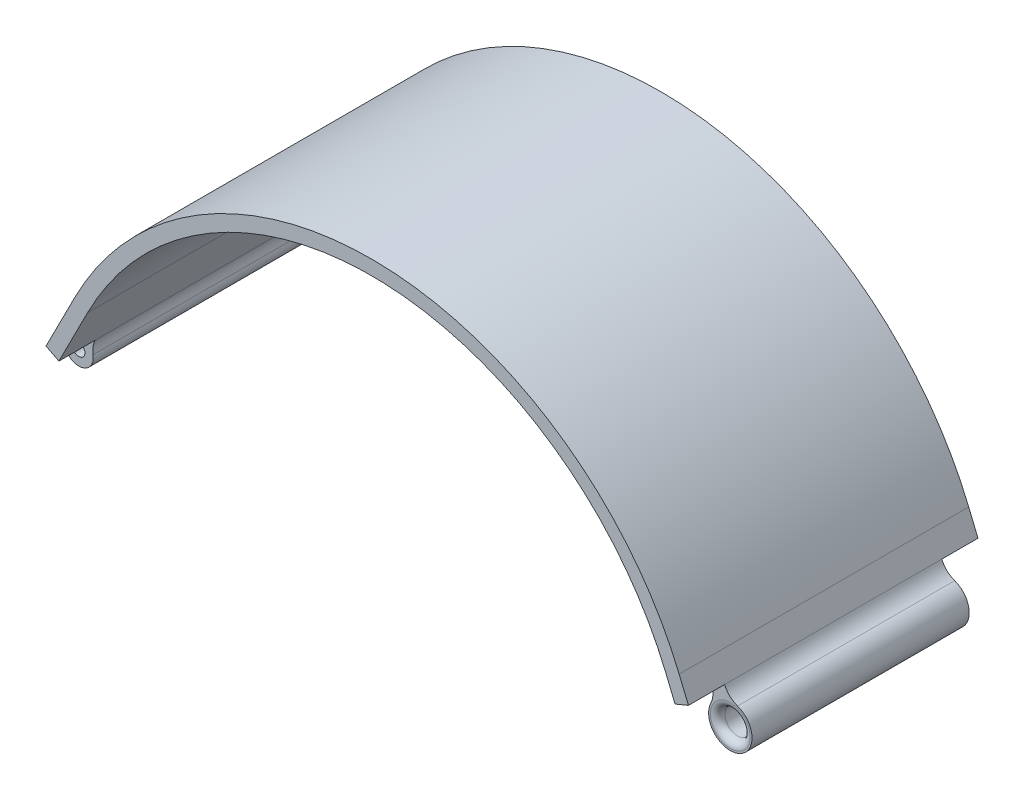
ISO-10303-21;
HEADER;
FILE_DESCRIPTION(('STEP AP214'),'2;1');
FILE_NAME('part.step','',(''),(''),'','','');
FILE_SCHEMA(('AUTOMOTIVE_DESIGN { 1 0 10303 214 1 1 1 1 }'));
ENDSEC;
DATA;
#1=APPLICATION_CONTEXT('core data for automotive mechanical design processes');
#2=APPLICATION_PROTOCOL_DEFINITION('international standard','automotive_design',2000,#1);
#3=PRODUCT_CONTEXT('',#1,'mechanical');
#4=PRODUCT('Part','Part','',(#3));
#5=PRODUCT_RELATED_PRODUCT_CATEGORY('part','',(#4));
#6=PRODUCT_DEFINITION_FORMATION('','',#4);
#7=PRODUCT_DEFINITION_CONTEXT('part definition',#1,'design');
#8=PRODUCT_DEFINITION('design','',#6,#7);
#9=PRODUCT_DEFINITION_SHAPE('','',#8);
#10=(LENGTH_UNIT() NAMED_UNIT(*) SI_UNIT(.MILLI.,.METRE.));
#11=(NAMED_UNIT(*) PLANE_ANGLE_UNIT() SI_UNIT($,.RADIAN.));
#12=(NAMED_UNIT(*) SI_UNIT($,.STERADIAN.) SOLID_ANGLE_UNIT());
#13=UNCERTAINTY_MEASURE_WITH_UNIT(LENGTH_MEASURE(1.E-05),#10,'distance_accuracy_value','');
#14=(GEOMETRIC_REPRESENTATION_CONTEXT(3) GLOBAL_UNCERTAINTY_ASSIGNED_CONTEXT((#13)) GLOBAL_UNIT_ASSIGNED_CONTEXT((#10,
#11,#12)) REPRESENTATION_CONTEXT('',''));
#15=CARTESIAN_POINT('',(0.,0.,0.));
#16=DIRECTION('',(0.,0.,1.));
#17=DIRECTION('',(1.,0.,0.));
#18=AXIS2_PLACEMENT_3D('',#15,#16,#17);
#19=CARTESIAN_POINT('',(89.1515917232898,0.,40.));
#20=DIRECTION('',(0.,0.,-1.));
#21=DIRECTION('',(-1.,0.,0.));
#22=AXIS2_PLACEMENT_3D('',#19,#20,#21);
#23=CYLINDRICAL_SURFACE('',#22,6.);
#24=CARTESIAN_POINT('',(89.1515917232898,0.,30.));
#25=DIRECTION('',(0.,0.,-1.));
#26=DIRECTION('',(-1.,0.,0.));
#27=AXIS2_PLACEMENT_3D('',#24,#25,#26);
#28=CIRCLE('',#27,6.00000000000001);
#29=CARTESIAN_POINT('',(91.1387665342734,5.66137229570643,30.));
#30=VERTEX_POINT('',#29);
#31=CARTESIAN_POINT('',(83.7460719026731,2.60391157087167,30.));
#32=VERTEX_POINT('',#31);
#33=EDGE_CURVE('E369',#30,#32,#28,.T.);
#34=ORIENTED_EDGE('',*,*,#33,.T.);
#35=DIRECTION('',(0.,0.,-1.));
#36=VECTOR('',#35,1.);
#37=CARTESIAN_POINT('',(83.7460719026731,2.60391157087167,40.));
#38=LINE('',#37,#36);
#39=CARTESIAN_POINT('',(83.7460719026731,2.60391157087167,-30.));
#40=VERTEX_POINT('',#39);
#41=EDGE_CURVE('E288',#32,#40,#38,.T.);
#42=ORIENTED_EDGE('',*,*,#41,.T.);
#43=CARTESIAN_POINT('',(89.1515917232898,0.,-30.));
#44=DIRECTION('',(0.,0.,-1.));
#45=DIRECTION('',(-1.,0.,0.));
#46=AXIS2_PLACEMENT_3D('',#43,#44,#45);
#47=CIRCLE('',#46,6.00000000000001);
#48=CARTESIAN_POINT('',(91.1387665342734,5.66137229570643,-30.));
#49=VERTEX_POINT('',#48);
#50=EDGE_CURVE('E349',#49,#40,#47,.T.);
#51=ORIENTED_EDGE('',*,*,#50,.F.);
#52=DIRECTION('',(0.,0.,-1.));
#53=VECTOR('',#52,1.);
#54=CARTESIAN_POINT('',(91.1387665342734,5.66137229570643,40.));
#55=LINE('',#54,#53);
#56=EDGE_CURVE('E290',#49,#30,#55,.F.);
#57=ORIENTED_EDGE('',*,*,#56,.T.);
#58=EDGE_LOOP('',(#34,#42,#51,#57));
#59=FACE_BOUND('',#58,.T.);
#60=ADVANCED_FACE('F48',(#59),#23,.T.);
#61=CARTESIAN_POINT('',(-90.8484082767102,0.,40.));
#62=DIRECTION('',(0.,0.,-1.));
#63=DIRECTION('',(-1.,0.,0.));
#64=AXIS2_PLACEMENT_3D('',#61,#62,#63);
#65=CYLINDRICAL_SURFACE('',#64,3.99999999999999);
#66=CARTESIAN_POINT('',(-90.8484082767102,0.,30.));
#67=DIRECTION('',(0.,0.,-1.));
#68=DIRECTION('',(-1.,0.,0.));
#69=AXIS2_PLACEMENT_3D('',#66,#67,#68);
#70=CIRCLE('',#69,3.99999999999999);
#71=CARTESIAN_POINT('',(-86.9077940215449,0.686701748933145,30.));
#72=VERTEX_POINT('',#71);
#73=CARTESIAN_POINT('',(-92.6110139471323,3.59071319525742,30.));
#74=VERTEX_POINT('',#73);
#75=EDGE_CURVE('E173',#72,#74,#70,.T.);
#76=ORIENTED_EDGE('',*,*,#75,.T.);
#77=DIRECTION('',(0.,0.,-1.));
#78=VECTOR('',#77,1.);
#79=CARTESIAN_POINT('',(-92.6110139471323,3.59071319525741,40.));
#80=LINE('',#79,#78);
#81=CARTESIAN_POINT('',(-92.6110139471323,3.59071319525742,-30.));
#82=VERTEX_POINT('',#81);
#83=EDGE_CURVE('E187',#74,#82,#80,.T.);
#84=ORIENTED_EDGE('',*,*,#83,.T.);
#85=CARTESIAN_POINT('',(-90.8484082767102,0.,-30.));
#86=DIRECTION('',(0.,0.,-1.));
#87=DIRECTION('',(-1.,0.,0.));
#88=AXIS2_PLACEMENT_3D('',#85,#86,#87);
#89=CIRCLE('',#88,3.99999999999999);
#90=CARTESIAN_POINT('',(-86.9077940215449,0.686701748933145,-30.));
#91=VERTEX_POINT('',#90);
#92=EDGE_CURVE('E278',#91,#82,#89,.T.);
#93=ORIENTED_EDGE('',*,*,#92,.F.);
#94=DIRECTION('',(0.,0.,-1.));
#95=VECTOR('',#94,1.);
#96=CARTESIAN_POINT('',(-86.9077940215449,0.686701748933146,40.));
#97=LINE('',#96,#95);
#98=EDGE_CURVE('E194',#91,#72,#97,.F.);
#99=ORIENTED_EDGE('',*,*,#98,.T.);
#100=EDGE_LOOP('',(#76,#84,#93,#99));
#101=FACE_BOUND('',#100,.T.);
#102=ADVANCED_FACE('F222',(#101),#65,.T.);
#103=CARTESIAN_POINT('',(89.1515917232898,0.,40.));
#104=DIRECTION('',(0.,0.,-1.));
#105=DIRECTION('',(-1.,0.,0.));
#106=AXIS2_PLACEMENT_3D('',#103,#104,#105);
#107=CYLINDRICAL_SURFACE('',#106,3.50000000000001);
#108=CARTESIAN_POINT('',(89.1515917232898,0.,-28.));
#109=DIRECTION('',(0.,0.,-1.));
#110=DIRECTION('',(-1.,0.,0.));
#111=AXIS2_PLACEMENT_3D('',#108,#109,#110);
#112=CIRCLE('',#111,3.50000000000001);
#113=CARTESIAN_POINT('',(85.6515917232898,0.,-28.));
#114=VERTEX_POINT('',#113);
#115=EDGE_CURVE('E204',#114,#114,#112,.T.);
#116=ORIENTED_EDGE('',*,*,#115,.T.);
#117=EDGE_LOOP('',(#116));
#118=FACE_BOUND('',#117,.T.);
#119=CARTESIAN_POINT('',(89.1515917232898,0.,28.));
#120=DIRECTION('',(0.,0.,1.));
#121=DIRECTION('',(1.,0.,0.));
#122=AXIS2_PLACEMENT_3D('',#119,#120,#121);
#123=CIRCLE('',#122,3.50000000000001);
#124=CARTESIAN_POINT('',(92.6515917232898,0.,28.));
#125=VERTEX_POINT('',#124);
#126=EDGE_CURVE('E201',#125,#125,#123,.T.);
#127=ORIENTED_EDGE('',*,*,#126,.T.);
#128=EDGE_LOOP('',(#127));
#129=FACE_BOUND('',#128,.T.);
#130=ADVANCED_FACE('F218',(#118,#129),#107,.F.);
#131=CARTESIAN_POINT('',(-90.8484082767102,0.,40.));
#132=DIRECTION('',(0.,0.,-1.));
#133=DIRECTION('',(-1.,0.,0.));
#134=AXIS2_PLACEMENT_3D('',#131,#132,#133);
#135=CYLINDRICAL_SURFACE('',#134,1.7);
#136=CARTESIAN_POINT('',(-90.8484082767102,0.,-30.));
#137=DIRECTION('',(0.,0.,-1.));
#138=DIRECTION('',(-1.,0.,0.));
#139=AXIS2_PLACEMENT_3D('',#136,#137,#138);
#140=CIRCLE('',#139,1.7);
#141=CARTESIAN_POINT('',(-92.5484082767102,0.,-30.));
#142=VERTEX_POINT('',#141);
#143=EDGE_CURVE('E321',#142,#142,#140,.T.);
#144=ORIENTED_EDGE('',*,*,#143,.T.);
#145=EDGE_LOOP('',(#144));
#146=FACE_BOUND('',#145,.T.);
#147=CARTESIAN_POINT('',(-90.8484082767102,0.,30.));
#148=DIRECTION('',(0.,0.,1.));
#149=DIRECTION('',(1.,0.,0.));
#150=AXIS2_PLACEMENT_3D('',#147,#148,#149);
#151=CIRCLE('',#150,1.7);
#152=CARTESIAN_POINT('',(-89.1484082767102,0.,30.));
#153=VERTEX_POINT('',#152);
#154=EDGE_CURVE('E172',#153,#153,#151,.T.);
#155=ORIENTED_EDGE('',*,*,#154,.T.);
#156=EDGE_LOOP('',(#155));
#157=FACE_BOUND('',#156,.T.);
#158=ADVANCED_FACE('F221',(#146,#157),#135,.F.);
#159=CARTESIAN_POINT('',(78.3405520820563,5.20782314174335,40.));
#160=DIRECTION('',(0.,0.,-1.));
#161=DIRECTION('',(-1.,0.,0.));
#162=AXIS2_PLACEMENT_3D('',#159,#160,#161);
#163=CYLINDRICAL_SURFACE('',#162,6.);
#164=CARTESIAN_POINT('',(78.3405520820563,5.20782314174335,30.));
#165=DIRECTION('',(0.,0.,1.));
#166=DIRECTION('',(-1.,0.,0.));
#167=AXIS2_PLACEMENT_3D('',#164,#165,#166);
#168=CIRCLE('',#167,6.);
#169=CARTESIAN_POINT('',(83.8850730557566,7.5009186853694,30.));
#170=VERTEX_POINT('',#169);
#171=EDGE_CURVE('E374',#32,#170,#168,.T.);
#172=ORIENTED_EDGE('',*,*,#171,.T.);
#173=DIRECTION('',(0.,0.,1.));
#174=VECTOR('',#173,1.);
#175=CARTESIAN_POINT('',(83.8850730557566,7.5009186853694,40.));
#176=LINE('',#175,#174);
#177=CARTESIAN_POINT('',(83.8850730557566,7.5009186853694,-30.));
#178=VERTEX_POINT('',#177);
#179=EDGE_CURVE('E287',#178,#170,#176,.T.);
#180=ORIENTED_EDGE('',*,*,#179,.F.);
#181=CARTESIAN_POINT('',(78.3405520820563,5.20782314174335,-30.));
#182=DIRECTION('',(0.,0.,1.));
#183=DIRECTION('',(-1.,0.,0.));
#184=AXIS2_PLACEMENT_3D('',#181,#182,#183);
#185=CIRCLE('',#184,6.);
#186=EDGE_CURVE('E347',#40,#178,#185,.T.);
#187=ORIENTED_EDGE('',*,*,#186,.F.);
#188=ORIENTED_EDGE('',*,*,#41,.F.);
#189=EDGE_LOOP('',(#172,#180,#187,#188));
#190=FACE_BOUND('',#189,.T.);
#191=ADVANCED_FACE('F253',(#190),#163,.F.);
#192=CARTESIAN_POINT('',(93.125941345257,11.3227445914129,40.));
#193=DIRECTION('',(0.,0.,-1.));
#194=DIRECTION('',(-1.,0.,0.));
#195=AXIS2_PLACEMENT_3D('',#192,#193,#194);
#196=CYLINDRICAL_SURFACE('',#195,6.);
#197=CARTESIAN_POINT('',(93.125941345257,11.3227445914129,30.));
#198=DIRECTION('',(0.,0.,1.));
#199=DIRECTION('',(-1.,0.,0.));
#200=AXIS2_PLACEMENT_3D('',#197,#198,#199);
#201=CIRCLE('',#200,6.);
#202=CARTESIAN_POINT('',(87.5814203715567,9.02964904778679,30.));
#203=VERTEX_POINT('',#202);
#204=EDGE_CURVE('E63',#203,#30,#201,.T.);
#205=ORIENTED_EDGE('',*,*,#204,.T.);
#206=ORIENTED_EDGE('',*,*,#56,.F.);
#207=CARTESIAN_POINT('',(93.125941345257,11.3227445914129,-30.));
#208=DIRECTION('',(0.,0.,1.));
#209=DIRECTION('',(-1.,0.,0.));
#210=AXIS2_PLACEMENT_3D('',#207,#208,#209);
#211=CIRCLE('',#210,6.);
#212=CARTESIAN_POINT('',(87.5814203715567,9.02964904778679,-30.));
#213=VERTEX_POINT('',#212);
#214=EDGE_CURVE('E344',#213,#49,#211,.T.);
#215=ORIENTED_EDGE('',*,*,#214,.F.);
#216=DIRECTION('',(0.,0.,1.));
#217=VECTOR('',#216,1.);
#218=CARTESIAN_POINT('',(87.5814203715567,9.02964904778679,-40.));
#219=LINE('',#218,#217);
#220=EDGE_CURVE('E281',#203,#213,#219,.F.);
#221=ORIENTED_EDGE('',*,*,#220,.F.);
#222=EDGE_LOOP('',(#205,#206,#215,#221));
#223=FACE_BOUND('',#222,.T.);
#224=ADVANCED_FACE('F256',(#223),#196,.F.);
#225=CARTESIAN_POINT('',(-95.2549224527655,8.97678298814355,40.));
#226=DIRECTION('',(0.,0.,-1.));
#227=DIRECTION('',(-1.,0.,0.));
#228=AXIS2_PLACEMENT_3D('',#225,#226,#227);
#229=CYLINDRICAL_SURFACE('',#228,6.);
#230=CARTESIAN_POINT('',(-95.2549224527655,8.97678298814355,30.));
#231=DIRECTION('',(0.,0.,1.));
#232=DIRECTION('',(-1.,0.,0.));
#233=AXIS2_PLACEMENT_3D('',#230,#231,#232);
#234=CIRCLE('',#233,6.);
#235=CARTESIAN_POINT('',(-89.9081537725273,6.25427225721453,30.));
#236=VERTEX_POINT('',#235);
#237=EDGE_CURVE('E177',#74,#236,#234,.T.);
#238=ORIENTED_EDGE('',*,*,#237,.T.);
#239=DIRECTION('',(0.,0.,1.));
#240=VECTOR('',#239,1.);
#241=CARTESIAN_POINT('',(-89.9081537725273,6.25427225721453,40.));
#242=LINE('',#241,#240);
#243=CARTESIAN_POINT('',(-89.9081537725273,6.25427225721453,-30.));
#244=VERTEX_POINT('',#243);
#245=EDGE_CURVE('E185',#244,#236,#242,.T.);
#246=ORIENTED_EDGE('',*,*,#245,.F.);
#247=CARTESIAN_POINT('',(-95.2549224527655,8.97678298814355,-30.));
#248=DIRECTION('',(0.,0.,1.));
#249=DIRECTION('',(-1.,0.,0.));
#250=AXIS2_PLACEMENT_3D('',#247,#248,#249);
#251=CIRCLE('',#250,6.);
#252=EDGE_CURVE('E360',#82,#244,#251,.T.);
#253=ORIENTED_EDGE('',*,*,#252,.F.);
#254=ORIENTED_EDGE('',*,*,#83,.F.);
#255=EDGE_LOOP('',(#238,#246,#253,#254));
#256=FACE_BOUND('',#255,.T.);
#257=ADVANCED_FACE('F183',(#256),#229,.F.);
#258=CARTESIAN_POINT('',(-80.9968726387969,1.71675437233287,40.));
#259=DIRECTION('',(0.,0.,-1.));
#260=DIRECTION('',(-1.,0.,0.));
#261=AXIS2_PLACEMENT_3D('',#258,#259,#260);
#262=CYLINDRICAL_SURFACE('',#261,6.);
#263=CARTESIAN_POINT('',(-80.9968726387969,1.71675437233287,30.));
#264=DIRECTION('',(0.,0.,1.));
#265=DIRECTION('',(-1.,0.,0.));
#266=AXIS2_PLACEMENT_3D('',#263,#264,#265);
#267=CIRCLE('',#266,6.);
#268=CARTESIAN_POINT('',(-86.3436413190351,4.43926510326191,30.));
#269=VERTEX_POINT('',#268);
#270=EDGE_CURVE('E71',#269,#72,#267,.T.);
#271=ORIENTED_EDGE('',*,*,#270,.T.);
#272=ORIENTED_EDGE('',*,*,#98,.F.);
#273=CARTESIAN_POINT('',(-80.9968726387969,1.71675437233287,-30.));
#274=DIRECTION('',(0.,0.,1.));
#275=DIRECTION('',(-1.,0.,0.));
#276=AXIS2_PLACEMENT_3D('',#273,#274,#275);
#277=CIRCLE('',#276,6.);
#278=CARTESIAN_POINT('',(-86.3436413190351,4.43926510326191,-30.));
#279=VERTEX_POINT('',#278);
#280=EDGE_CURVE('E357',#279,#91,#277,.T.);
#281=ORIENTED_EDGE('',*,*,#280,.F.);
#282=DIRECTION('',(0.,0.,1.));
#283=VECTOR('',#282,1.);
#284=CARTESIAN_POINT('',(-86.3436413190351,4.43926510326191,-40.));
#285=LINE('',#284,#283);
#286=EDGE_CURVE('E193',#269,#279,#285,.F.);
#287=ORIENTED_EDGE('',*,*,#286,.F.);
#288=EDGE_LOOP('',(#271,#272,#281,#287));
#289=FACE_BOUND('',#288,.T.);
#290=ADVANCED_FACE('F263',(#289),#262,.F.);
#291=CARTESIAN_POINT('',(0.,-19.9281403596445,40.));
#292=DIRECTION('',(0.,0.,-1.));
#293=DIRECTION('',(-1.,0.,0.));
#294=AXIS2_PLACEMENT_3D('',#291,#292,#293);
#295=PLANE('',#294);
#296=DIRECTION('',(0.891128113373042,-0.453751788488158,0.));
#297=VECTOR('',#296,1.);
#298=CARTESIAN_POINT('',(-89.9081537725273,6.25427225721453,40.));
#299=LINE('',#298,#297);
#300=CARTESIAN_POINT('',(-89.9081537725273,6.25427225721453,40.));
#301=VERTEX_POINT('',#300);
#302=CARTESIAN_POINT('',(-86.3436413190351,4.4392651032619,40.));
#303=VERTEX_POINT('',#302);
#304=EDGE_CURVE('E167',#301,#303,#299,.T.);
#305=ORIENTED_EDGE('',*,*,#304,.T.);
#306=DIRECTION('',(0.453751788488172,0.891128113373035,0.));
#307=VECTOR('',#306,1.);
#308=CARTESIAN_POINT('',(-78.4192739768272,20.0020170273146,40.));
#309=LINE('',#308,#307);
#310=CARTESIAN_POINT('',(-78.4192739768272,20.0020170273146,40.));
#311=VERTEX_POINT('',#310);
#312=EDGE_CURVE('E305',#303,#311,#309,.T.);
#313=ORIENTED_EDGE('',*,*,#312,.T.);
#314=CARTESIAN_POINT('',(0.,-19.9281403596445,40.));
#315=DIRECTION('',(0.,0.,-1.));
#316=DIRECTION('',(-1.,0.,0.));
#317=AXIS2_PLACEMENT_3D('',#314,#315,#316);
#318=CIRCLE('',#317,88.);
#319=CARTESIAN_POINT('',(81.3196409476041,13.7039276135378,40.));
#320=VERTEX_POINT('',#319);
#321=EDGE_CURVE('E308',#311,#320,#318,.T.);
#322=ORIENTED_EDGE('',*,*,#321,.T.);
#323=DIRECTION('',(0.382182590604342,-0.924086828950047,0.));
#324=VECTOR('',#323,1.);
#325=CARTESIAN_POINT('',(81.3196409476041,13.7039276135378,40.));
#326=LINE('',#325,#324);
#327=CARTESIAN_POINT('',(83.8850730557566,7.5009186853694,40.));
#328=VERTEX_POINT('',#327);
#329=EDGE_CURVE('E329',#320,#328,#326,.T.);
#330=ORIENTED_EDGE('',*,*,#329,.T.);
#331=DIRECTION('',(0.924086828950044,0.382182590604349,0.));
#332=VECTOR('',#331,1.);
#333=CARTESIAN_POINT('',(87.5814203715567,9.02964904778679,40.));
#334=LINE('',#333,#332);
#335=CARTESIAN_POINT('',(87.5814203715567,9.02964904778679,40.));
#336=VERTEX_POINT('',#335);
#337=EDGE_CURVE('E370',#328,#336,#334,.T.);
#338=ORIENTED_EDGE('',*,*,#337,.T.);
#339=DIRECTION('',(-0.382182590604344,0.924086828950047,0.));
#340=VECTOR('',#339,1.);
#341=CARTESIAN_POINT('',(85.0159882634043,15.2326579759552,40.));
#342=LINE('',#341,#340);
#343=CARTESIAN_POINT('',(85.0159882634043,15.2326579759552,40.));
#344=VERTEX_POINT('',#343);
#345=EDGE_CURVE('E327',#336,#344,#342,.T.);
#346=ORIENTED_EDGE('',*,*,#345,.T.);
#347=CARTESIAN_POINT('',(0.,-19.9281403596445,40.));
#348=DIRECTION('',(0.,0.,1.));
#349=DIRECTION('',(-1.,0.,0.));
#350=AXIS2_PLACEMENT_3D('',#347,#348,#349);
#351=CIRCLE('',#350,92.);
#352=CARTESIAN_POINT('',(-81.9837864303193,21.8170241812673,40.));
#353=VERTEX_POINT('',#352);
#354=EDGE_CURVE('E325',#344,#353,#351,.T.);
#355=ORIENTED_EDGE('',*,*,#354,.T.);
#356=DIRECTION('',(-0.453751788488171,-0.891128113373036,0.));
#357=VECTOR('',#356,1.);
#358=CARTESIAN_POINT('',(-81.9837864303193,21.8170241812673,40.));
#359=LINE('',#358,#357);
#360=EDGE_CURVE('E323',#353,#301,#359,.T.);
#361=ORIENTED_EDGE('',*,*,#360,.T.);
#362=EDGE_LOOP('',(#305,#313,#322,#330,#338,#346,#355,#361));
#363=FACE_BOUND('',#362,.T.);
#364=ADVANCED_FACE('F265',(#363),#295,.F.);
#365=CARTESIAN_POINT('',(0.,-19.9281403596445,-40.));
#366=DIRECTION('',(0.,0.,-1.));
#367=DIRECTION('',(-1.,0.,0.));
#368=AXIS2_PLACEMENT_3D('',#365,#366,#367);
#369=PLANE('',#368);
#370=DIRECTION('',(0.891128113373042,-0.453751788488158,0.));
#371=VECTOR('',#370,1.);
#372=CARTESIAN_POINT('',(-89.9081537725273,6.25427225721453,-40.));
#373=LINE('',#372,#371);
#374=CARTESIAN_POINT('',(-89.9081537725273,6.25427225721453,-40.));
#375=VERTEX_POINT('',#374);
#376=CARTESIAN_POINT('',(-86.3436413190351,4.4392651032619,-40.));
#377=VERTEX_POINT('',#376);
#378=EDGE_CURVE('E340',#375,#377,#373,.T.);
#379=ORIENTED_EDGE('',*,*,#378,.F.);
#380=DIRECTION('',(-0.453751788488171,-0.891128113373036,0.));
#381=VECTOR('',#380,1.);
#382=CARTESIAN_POINT('',(-81.9837864303193,21.8170241812673,-40.));
#383=LINE('',#382,#381);
#384=CARTESIAN_POINT('',(-81.9837864303193,21.8170241812673,-40.));
#385=VERTEX_POINT('',#384);
#386=EDGE_CURVE('E309',#385,#375,#383,.T.);
#387=ORIENTED_EDGE('',*,*,#386,.F.);
#388=CARTESIAN_POINT('',(0.,-19.9281403596445,-40.));
#389=DIRECTION('',(0.,0.,1.));
#390=DIRECTION('',(-1.,0.,0.));
#391=AXIS2_PLACEMENT_3D('',#388,#389,#390);
#392=CIRCLE('',#391,92.);
#393=CARTESIAN_POINT('',(85.0159882634043,15.2326579759552,-40.));
#394=VERTEX_POINT('',#393);
#395=EDGE_CURVE('E311',#394,#385,#392,.T.);
#396=ORIENTED_EDGE('',*,*,#395,.F.);
#397=DIRECTION('',(-0.382182590604344,0.924086828950047,0.));
#398=VECTOR('',#397,1.);
#399=CARTESIAN_POINT('',(85.0159882634043,15.2326579759552,-40.));
#400=LINE('',#399,#398);
#401=CARTESIAN_POINT('',(87.5814203715567,9.02964904778679,-40.));
#402=VERTEX_POINT('',#401);
#403=EDGE_CURVE('E313',#402,#394,#400,.T.);
#404=ORIENTED_EDGE('',*,*,#403,.F.);
#405=DIRECTION('',(0.924086828950044,0.382182590604349,0.));
#406=VECTOR('',#405,1.);
#407=CARTESIAN_POINT('',(87.5814203715567,9.02964904778679,-40.));
#408=LINE('',#407,#406);
#409=CARTESIAN_POINT('',(83.8850730557566,7.5009186853694,-40.));
#410=VERTEX_POINT('',#409);
#411=EDGE_CURVE('E342',#410,#402,#408,.T.);
#412=ORIENTED_EDGE('',*,*,#411,.F.);
#413=DIRECTION('',(0.382182590604342,-0.924086828950047,0.));
#414=VECTOR('',#413,1.);
#415=CARTESIAN_POINT('',(81.3196409476041,13.7039276135378,-40.));
#416=LINE('',#415,#414);
#417=CARTESIAN_POINT('',(81.3196409476041,13.7039276135378,-40.));
#418=VERTEX_POINT('',#417);
#419=EDGE_CURVE('E315',#418,#410,#416,.T.);
#420=ORIENTED_EDGE('',*,*,#419,.F.);
#421=CARTESIAN_POINT('',(0.,-19.9281403596445,-40.));
#422=DIRECTION('',(0.,0.,-1.));
#423=DIRECTION('',(-1.,0.,0.));
#424=AXIS2_PLACEMENT_3D('',#421,#422,#423);
#425=CIRCLE('',#424,88.);
#426=CARTESIAN_POINT('',(-78.4192739768272,20.0020170273146,-40.));
#427=VERTEX_POINT('',#426);
#428=EDGE_CURVE('E318',#427,#418,#425,.T.);
#429=ORIENTED_EDGE('',*,*,#428,.F.);
#430=DIRECTION('',(0.453751788488172,0.891128113373035,0.));
#431=VECTOR('',#430,1.);
#432=CARTESIAN_POINT('',(-78.4192739768272,20.0020170273146,-40.));
#433=LINE('',#432,#431);
#434=EDGE_CURVE('E306',#377,#427,#433,.T.);
#435=ORIENTED_EDGE('',*,*,#434,.F.);
#436=EDGE_LOOP('',(#379,#387,#396,#404,#412,#420,#429,#435));
#437=FACE_BOUND('',#436,.T.);
#438=ADVANCED_FACE('F251',(#437),#369,.T.);
#439=CARTESIAN_POINT('',(0.,-19.9281403596445,40.));
#440=DIRECTION('',(0.,0.,-1.));
#441=DIRECTION('',(-1.,0.,0.));
#442=AXIS2_PLACEMENT_3D('',#439,#440,#441);
#443=CYLINDRICAL_SURFACE('',#442,88.);
#444=ORIENTED_EDGE('',*,*,#428,.T.);
#445=DIRECTION('',(0.,0.,-1.));
#446=VECTOR('',#445,1.);
#447=CARTESIAN_POINT('',(81.3196409476041,13.7039276135378,40.));
#448=LINE('',#447,#446);
#449=EDGE_CURVE('E293',#320,#418,#448,.T.);
#450=ORIENTED_EDGE('',*,*,#449,.F.);
#451=ORIENTED_EDGE('',*,*,#321,.F.);
#452=DIRECTION('',(0.,0.,-1.));
#453=VECTOR('',#452,1.);
#454=CARTESIAN_POINT('',(-78.4192739768272,20.0020170273146,40.));
#455=LINE('',#454,#453);
#456=EDGE_CURVE('E302',#311,#427,#455,.T.);
#457=ORIENTED_EDGE('',*,*,#456,.T.);
#458=EDGE_LOOP('',(#444,#450,#451,#457));
#459=FACE_BOUND('',#458,.T.);
#460=ADVANCED_FACE('F247',(#459),#443,.F.);
#461=CARTESIAN_POINT('',(81.3196409476041,13.7039276135378,40.));
#462=DIRECTION('',(0.924086828950047,0.382182590604342,0.));
#463=DIRECTION('',(-0.382182590604342,0.924086828950047,0.));
#464=AXIS2_PLACEMENT_3D('',#461,#462,#463);
#465=PLANE('',#464);
#466=ORIENTED_EDGE('',*,*,#419,.T.);
#467=EDGE_CURVE('E284',#410,#178,#176,.T.);
#468=ORIENTED_EDGE('',*,*,#467,.T.);
#469=ORIENTED_EDGE('',*,*,#179,.T.);
#470=DIRECTION('',(0.,0.,1.));
#471=VECTOR('',#470,1.);
#472=CARTESIAN_POINT('',(83.8850730557566,7.5009186853694,30.));
#473=LINE('',#472,#471);
#474=EDGE_CURVE('E366',#170,#328,#473,.T.);
#475=ORIENTED_EDGE('',*,*,#474,.T.);
#476=ORIENTED_EDGE('',*,*,#329,.F.);
#477=ORIENTED_EDGE('',*,*,#449,.T.);
#478=EDGE_LOOP('',(#466,#468,#469,#475,#476,#477));
#479=FACE_BOUND('',#478,.T.);
#480=ADVANCED_FACE('F244',(#479),#465,.F.);
#481=CARTESIAN_POINT('',(85.0159882634043,15.2326579759552,40.));
#482=DIRECTION('',(-0.924086828950046,-0.382182590604344,0.));
#483=DIRECTION('',(0.382182590604344,-0.924086828950046,0.));
#484=AXIS2_PLACEMENT_3D('',#481,#482,#483);
#485=PLANE('',#484);
#486=ORIENTED_EDGE('',*,*,#345,.F.);
#487=EDGE_CURVE('E279',#336,#203,#219,.F.);
#488=ORIENTED_EDGE('',*,*,#487,.T.);
#489=ORIENTED_EDGE('',*,*,#220,.T.);
#490=DIRECTION('',(0.,0.,-1.));
#491=VECTOR('',#490,1.);
#492=CARTESIAN_POINT('',(87.5814203715567,9.02964904778679,-30.));
#493=LINE('',#492,#491);
#494=EDGE_CURVE('E337',#213,#402,#493,.T.);
#495=ORIENTED_EDGE('',*,*,#494,.T.);
#496=ORIENTED_EDGE('',*,*,#403,.T.);
#497=DIRECTION('',(0.,0.,-1.));
#498=VECTOR('',#497,1.);
#499=CARTESIAN_POINT('',(85.0159882634043,15.2326579759552,40.));
#500=LINE('',#499,#498);
#501=EDGE_CURVE('E296',#344,#394,#500,.T.);
#502=ORIENTED_EDGE('',*,*,#501,.F.);
#503=EDGE_LOOP('',(#486,#488,#489,#495,#496,#502));
#504=FACE_BOUND('',#503,.T.);
#505=ADVANCED_FACE('F242',(#504),#485,.F.);
#506=CARTESIAN_POINT('',(0.,-19.9281403596445,40.));
#507=DIRECTION('',(0.,0.,-1.));
#508=DIRECTION('',(-1.,0.,0.));
#509=AXIS2_PLACEMENT_3D('',#506,#507,#508);
#510=CYLINDRICAL_SURFACE('',#509,92.);
#511=ORIENTED_EDGE('',*,*,#395,.T.);
#512=DIRECTION('',(0.,0.,-1.));
#513=VECTOR('',#512,1.);
#514=CARTESIAN_POINT('',(-81.9837864303193,21.8170241812673,40.));
#515=LINE('',#514,#513);
#516=EDGE_CURVE('E299',#353,#385,#515,.T.);
#517=ORIENTED_EDGE('',*,*,#516,.F.);
#518=ORIENTED_EDGE('',*,*,#354,.F.);
#519=ORIENTED_EDGE('',*,*,#501,.T.);
#520=EDGE_LOOP('',(#511,#517,#518,#519));
#521=FACE_BOUND('',#520,.T.);
#522=ADVANCED_FACE('F407',(#521),#510,.T.);
#523=CARTESIAN_POINT('',(-81.9837864303193,21.8170241812673,40.));
#524=DIRECTION('',(0.891128113373036,-0.453751788488171,0.));
#525=DIRECTION('',(0.453751788488171,0.891128113373036,0.));
#526=AXIS2_PLACEMENT_3D('',#523,#524,#525);
#527=PLANE('',#526);
#528=ORIENTED_EDGE('',*,*,#386,.T.);
#529=EDGE_CURVE('E191',#375,#244,#242,.T.);
#530=ORIENTED_EDGE('',*,*,#529,.T.);
#531=ORIENTED_EDGE('',*,*,#245,.T.);
#532=DIRECTION('',(0.,0.,1.));
#533=VECTOR('',#532,1.);
#534=CARTESIAN_POINT('',(-89.9081537725273,6.25427225721453,30.));
#535=LINE('',#534,#533);
#536=EDGE_CURVE('E162',#236,#301,#535,.T.);
#537=ORIENTED_EDGE('',*,*,#536,.T.);
#538=ORIENTED_EDGE('',*,*,#360,.F.);
#539=ORIENTED_EDGE('',*,*,#516,.T.);
#540=EDGE_LOOP('',(#528,#530,#531,#537,#538,#539));
#541=FACE_BOUND('',#540,.T.);
#542=ADVANCED_FACE('F190',(#541),#527,.F.);
#543=CARTESIAN_POINT('',(-78.4192739768272,20.0020170273146,40.));
#544=DIRECTION('',(-0.891128113373035,0.453751788488172,0.));
#545=DIRECTION('',(-0.453751788488172,-0.891128113373035,0.));
#546=AXIS2_PLACEMENT_3D('',#543,#544,#545);
#547=PLANE('',#546);
#548=ORIENTED_EDGE('',*,*,#312,.F.);
#549=EDGE_CURVE('E198',#303,#269,#285,.F.);
#550=ORIENTED_EDGE('',*,*,#549,.T.);
#551=ORIENTED_EDGE('',*,*,#286,.T.);
#552=DIRECTION('',(0.,0.,-1.));
#553=VECTOR('',#552,1.);
#554=CARTESIAN_POINT('',(-86.3436413190351,4.4392651032619,-30.));
#555=LINE('',#554,#553);
#556=EDGE_CURVE('E336',#279,#377,#555,.T.);
#557=ORIENTED_EDGE('',*,*,#556,.T.);
#558=ORIENTED_EDGE('',*,*,#434,.T.);
#559=ORIENTED_EDGE('',*,*,#456,.F.);
#560=EDGE_LOOP('',(#548,#550,#551,#557,#558,#559));
#561=FACE_BOUND('',#560,.T.);
#562=ADVANCED_FACE('F384',(#561),#547,.F.);
#563=CARTESIAN_POINT('',(-89.9081537725273,6.25427225721453,-30.));
#564=DIRECTION('',(0.453751788488158,0.891128113373042,0.));
#565=DIRECTION('',(-0.891128113373043,0.453751788488158,0.));
#566=AXIS2_PLACEMENT_3D('',#563,#564,#565);
#567=PLANE('',#566);
#568=ORIENTED_EDGE('',*,*,#378,.T.);
#569=ORIENTED_EDGE('',*,*,#556,.F.);
#570=DIRECTION('',(0.891128113373042,-0.453751788488158,0.));
#571=VECTOR('',#570,1.);
#572=CARTESIAN_POINT('',(-89.9081537725273,6.25427225721453,-30.));
#573=LINE('',#572,#571);
#574=EDGE_CURVE('E355',#244,#279,#573,.T.);
#575=ORIENTED_EDGE('',*,*,#574,.F.);
#576=ORIENTED_EDGE('',*,*,#529,.F.);
#577=EDGE_LOOP('',(#568,#569,#575,#576));
#578=FACE_BOUND('',#577,.T.);
#579=ADVANCED_FACE('F415',(#578),#567,.F.);
#580=CARTESIAN_POINT('',(-80.9968726387969,1.71675437233287,-30.));
#581=DIRECTION('',(0.,0.,-1.));
#582=DIRECTION('',(-1.,0.,0.));
#583=AXIS2_PLACEMENT_3D('',#580,#581,#582);
#584=PLANE('',#583);
#585=ORIENTED_EDGE('',*,*,#143,.F.);
#586=EDGE_LOOP('',(#585));
#587=FACE_BOUND('',#586,.T.);
#588=ORIENTED_EDGE('',*,*,#280,.T.);
#589=ORIENTED_EDGE('',*,*,#92,.T.);
#590=ORIENTED_EDGE('',*,*,#252,.T.);
#591=ORIENTED_EDGE('',*,*,#574,.T.);
#592=EDGE_LOOP('',(#588,#589,#590,#591));
#593=FACE_BOUND('',#592,.T.);
#594=ADVANCED_FACE('F418',(#587,#593),#584,.T.);
#595=CARTESIAN_POINT('',(87.5814203715567,9.02964904778679,-30.));
#596=DIRECTION('',(-0.382182590604349,0.924086828950044,0.));
#597=DIRECTION('',(-0.924086828950044,-0.382182590604349,0.));
#598=AXIS2_PLACEMENT_3D('',#595,#596,#597);
#599=PLANE('',#598);
#600=ORIENTED_EDGE('',*,*,#411,.T.);
#601=ORIENTED_EDGE('',*,*,#494,.F.);
#602=DIRECTION('',(0.924086828950044,0.382182590604349,0.));
#603=VECTOR('',#602,1.);
#604=CARTESIAN_POINT('',(87.5814203715567,9.02964904778679,-30.));
#605=LINE('',#604,#603);
#606=EDGE_CURVE('E341',#178,#213,#605,.T.);
#607=ORIENTED_EDGE('',*,*,#606,.F.);
#608=ORIENTED_EDGE('',*,*,#467,.F.);
#609=EDGE_LOOP('',(#600,#601,#607,#608));
#610=FACE_BOUND('',#609,.T.);
#611=ADVANCED_FACE('F420',(#610),#599,.F.);
#612=CARTESIAN_POINT('',(93.125941345257,11.3227445914129,-30.));
#613=DIRECTION('',(0.,0.,-1.));
#614=DIRECTION('',(-1.,0.,0.));
#615=AXIS2_PLACEMENT_3D('',#612,#613,#614);
#616=PLANE('',#615);
#617=CARTESIAN_POINT('',(89.1515917232898,0.,-30.));
#618=DIRECTION('',(0.,0.,-1.));
#619=DIRECTION('',(-1.,0.,0.));
#620=AXIS2_PLACEMENT_3D('',#617,#618,#619);
#621=CIRCLE('',#620,5.50000000000001);
#622=CARTESIAN_POINT('',(83.6515917232898,0.,-30.));
#623=VERTEX_POINT('',#622);
#624=EDGE_CURVE('E56',#623,#623,#621,.F.);
#625=ORIENTED_EDGE('',*,*,#624,.T.);
#626=EDGE_LOOP('',(#625));
#627=FACE_BOUND('',#626,.T.);
#628=ORIENTED_EDGE('',*,*,#214,.T.);
#629=ORIENTED_EDGE('',*,*,#50,.T.);
#630=ORIENTED_EDGE('',*,*,#186,.T.);
#631=ORIENTED_EDGE('',*,*,#606,.T.);
#632=EDGE_LOOP('',(#628,#629,#630,#631));
#633=FACE_BOUND('',#632,.T.);
#634=ADVANCED_FACE('F209',(#627,#633),#616,.T.);
#635=CARTESIAN_POINT('',(-89.9081537725273,6.25427225721453,30.));
#636=DIRECTION('',(-0.453751788488158,-0.891128113373042,0.));
#637=DIRECTION('',(0.891128113373043,-0.453751788488158,0.));
#638=AXIS2_PLACEMENT_3D('',#635,#636,#637);
#639=PLANE('',#638);
#640=ORIENTED_EDGE('',*,*,#304,.F.);
#641=ORIENTED_EDGE('',*,*,#536,.F.);
#642=DIRECTION('',(0.891128113373042,-0.453751788488158,0.));
#643=VECTOR('',#642,1.);
#644=CARTESIAN_POINT('',(-89.9081537725273,6.25427225721453,30.));
#645=LINE('',#644,#643);
#646=EDGE_CURVE('E164',#236,#269,#645,.T.);
#647=ORIENTED_EDGE('',*,*,#646,.T.);
#648=ORIENTED_EDGE('',*,*,#549,.F.);
#649=EDGE_LOOP('',(#640,#641,#647,#648));
#650=FACE_BOUND('',#649,.T.);
#651=ADVANCED_FACE('F163',(#650),#639,.T.);
#652=CARTESIAN_POINT('',(-80.9968726387969,1.71675437233287,30.));
#653=DIRECTION('',(0.,0.,1.));
#654=DIRECTION('',(-1.,0.,0.));
#655=AXIS2_PLACEMENT_3D('',#652,#653,#654);
#656=PLANE('',#655);
#657=ORIENTED_EDGE('',*,*,#154,.F.);
#658=EDGE_LOOP('',(#657));
#659=FACE_BOUND('',#658,.T.);
#660=ORIENTED_EDGE('',*,*,#270,.F.);
#661=ORIENTED_EDGE('',*,*,#646,.F.);
#662=ORIENTED_EDGE('',*,*,#237,.F.);
#663=ORIENTED_EDGE('',*,*,#75,.F.);
#664=EDGE_LOOP('',(#660,#661,#662,#663));
#665=FACE_BOUND('',#664,.T.);
#666=ADVANCED_FACE('F176',(#659,#665),#656,.T.);
#667=CARTESIAN_POINT('',(87.5814203715567,9.02964904778679,30.));
#668=DIRECTION('',(0.382182590604349,-0.924086828950044,0.));
#669=DIRECTION('',(0.924086828950044,0.382182590604349,0.));
#670=AXIS2_PLACEMENT_3D('',#667,#668,#669);
#671=PLANE('',#670);
#672=ORIENTED_EDGE('',*,*,#337,.F.);
#673=ORIENTED_EDGE('',*,*,#474,.F.);
#674=DIRECTION('',(0.924086828950044,0.382182590604349,0.));
#675=VECTOR('',#674,1.);
#676=CARTESIAN_POINT('',(87.5814203715567,9.02964904778679,30.));
#677=LINE('',#676,#675);
#678=EDGE_CURVE('E377',#170,#203,#677,.T.);
#679=ORIENTED_EDGE('',*,*,#678,.T.);
#680=ORIENTED_EDGE('',*,*,#487,.F.);
#681=EDGE_LOOP('',(#672,#673,#679,#680));
#682=FACE_BOUND('',#681,.T.);
#683=ADVANCED_FACE('F393',(#682),#671,.T.);
#684=CARTESIAN_POINT('',(93.125941345257,11.3227445914129,30.));
#685=DIRECTION('',(0.,0.,1.));
#686=DIRECTION('',(-1.,0.,0.));
#687=AXIS2_PLACEMENT_3D('',#684,#685,#686);
#688=PLANE('',#687);
#689=CARTESIAN_POINT('',(89.1515917232898,0.,30.));
#690=DIRECTION('',(0.,0.,1.));
#691=DIRECTION('',(1.,0.,0.));
#692=AXIS2_PLACEMENT_3D('',#689,#690,#691);
#693=CIRCLE('',#692,5.50000000000001);
#694=CARTESIAN_POINT('',(94.6515917232898,0.,30.));
#695=VERTEX_POINT('',#694);
#696=EDGE_CURVE('E13',#695,#695,#693,.F.);
#697=ORIENTED_EDGE('',*,*,#696,.T.);
#698=EDGE_LOOP('',(#697));
#699=FACE_BOUND('',#698,.T.);
#700=ORIENTED_EDGE('',*,*,#204,.F.);
#701=ORIENTED_EDGE('',*,*,#678,.F.);
#702=ORIENTED_EDGE('',*,*,#171,.F.);
#703=ORIENTED_EDGE('',*,*,#33,.F.);
#704=EDGE_LOOP('',(#700,#701,#702,#703));
#705=FACE_BOUND('',#704,.T.);
#706=ADVANCED_FACE('F215',(#699,#705),#688,.T.);
#707=CARTESIAN_POINT('',(89.1515917232898,0.,-28.));
#708=DIRECTION('',(0.,0.,-1.));
#709=DIRECTION('',(-1.,0.,0.));
#710=AXIS2_PLACEMENT_3D('',#707,#708,#709);
#711=TOROIDAL_SURFACE('',#710,5.50000000000001,2.);
#712=ORIENTED_EDGE('',*,*,#624,.F.);
#713=EDGE_LOOP('',(#712));
#714=FACE_BOUND('',#713,.T.);
#715=ORIENTED_EDGE('',*,*,#115,.F.);
#716=EDGE_LOOP('',(#715));
#717=FACE_BOUND('',#716,.T.);
#718=ADVANCED_FACE('F212',(#714,#717),#711,.T.);
#719=CARTESIAN_POINT('',(89.1515917232898,0.,28.));
#720=DIRECTION('',(0.,0.,1.));
#721=DIRECTION('',(1.,0.,0.));
#722=AXIS2_PLACEMENT_3D('',#719,#720,#721);
#723=TOROIDAL_SURFACE('',#722,5.50000000000001,2.);
#724=ORIENTED_EDGE('',*,*,#696,.F.);
#725=EDGE_LOOP('',(#724));
#726=FACE_BOUND('',#725,.T.);
#727=ORIENTED_EDGE('',*,*,#126,.F.);
#728=EDGE_LOOP('',(#727));
#729=FACE_BOUND('',#728,.T.);
#730=ADVANCED_FACE('F50',(#726,#729),#723,.T.);
#731=CLOSED_SHELL('',(#60,#102,#130,#158,#191,#224,#257,#290,#364,#438,#460,#480,#505,#522,#542,
#562,#579,#594,#611,#634,#651,#666,#683,#706,#718,#730));
#732=MANIFOLD_SOLID_BREP('B2',#731);
#733=ADVANCED_BREP_SHAPE_REPRESENTATION('',(#18,#732),#14);
#734=SHAPE_DEFINITION_REPRESENTATION(#9,#733);
ENDSEC;
END-ISO-10303-21;
